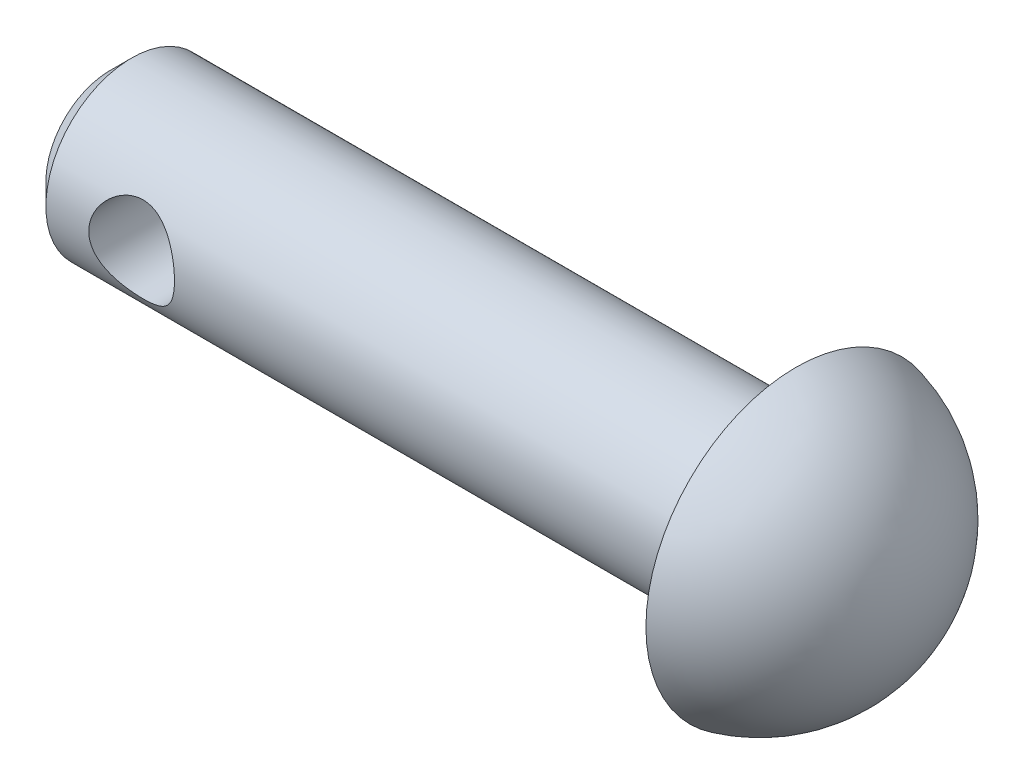
ISO-10303-21;
HEADER;
FILE_DESCRIPTION(('STEP AP214'),'2;1');
FILE_NAME('part.step','',(''),(''),'','','');
FILE_SCHEMA(('AUTOMOTIVE_DESIGN { 1 0 10303 214 1 1 1 1 }'));
ENDSEC;
DATA;
#1=APPLICATION_CONTEXT('core data for automotive mechanical design processes');
#2=APPLICATION_PROTOCOL_DEFINITION('international standard','automotive_design',2000,#1);
#3=PRODUCT_CONTEXT('',#1,'mechanical');
#4=PRODUCT('Part','Part','',(#3));
#5=PRODUCT_RELATED_PRODUCT_CATEGORY('part','',(#4));
#6=PRODUCT_DEFINITION_FORMATION('','',#4);
#7=PRODUCT_DEFINITION_CONTEXT('part definition',#1,'design');
#8=PRODUCT_DEFINITION('design','',#6,#7);
#9=PRODUCT_DEFINITION_SHAPE('','',#8);
#10=(LENGTH_UNIT() NAMED_UNIT(*) SI_UNIT(.MILLI.,.METRE.));
#11=(NAMED_UNIT(*) PLANE_ANGLE_UNIT() SI_UNIT($,.RADIAN.));
#12=(NAMED_UNIT(*) SI_UNIT($,.STERADIAN.) SOLID_ANGLE_UNIT());
#13=UNCERTAINTY_MEASURE_WITH_UNIT(LENGTH_MEASURE(1.E-05),#10,'distance_accuracy_value','');
#14=(GEOMETRIC_REPRESENTATION_CONTEXT(3) GLOBAL_UNCERTAINTY_ASSIGNED_CONTEXT((#13)) GLOBAL_UNIT_ASSIGNED_CONTEXT((#10,
#11,#12)) REPRESENTATION_CONTEXT('',''));
#15=CARTESIAN_POINT('',(0.,0.,0.));
#16=DIRECTION('',(0.,0.,1.));
#17=DIRECTION('',(1.,0.,0.));
#18=AXIS2_PLACEMENT_3D('',#15,#16,#17);
#19=CARTESIAN_POINT('',(-16.,0.,0.));
#20=DIRECTION('',(1.,0.,0.));
#21=DIRECTION('',(0.,0.,-1.));
#22=AXIS2_PLACEMENT_3D('',#19,#20,#21);
#23=CYLINDRICAL_SURFACE('',#22,2.);
#24=CARTESIAN_POINT('',(-15.5,0.,0.));
#25=DIRECTION('',(1.,0.,0.));
#26=DIRECTION('',(0.,0.,-1.));
#27=AXIS2_PLACEMENT_3D('',#24,#25,#26);
#28=CIRCLE('',#27,2.);
#29=CARTESIAN_POINT('',(-15.5,0.,-2.));
#30=VERTEX_POINT('',#29);
#31=EDGE_CURVE('E45',#30,#30,#28,.T.);
#32=ORIENTED_EDGE('',*,*,#31,.T.);
#33=EDGE_LOOP('',(#32));
#34=FACE_BOUND('',#33,.T.);
#35=CARTESIAN_POINT('',(-12.5,0.,-2.));
#36=CARTESIAN_POINT('',(-12.5000033023195,-0.0525719629529866,-1.99999713404151));
#37=CARTESIAN_POINT('',(-12.5041700731217,-0.105206599698033,-1.99790491019518));
#38=CARTESIAN_POINT('',(-12.5206528803409,-0.208920235268425,-1.98974156037396));
#39=CARTESIAN_POINT('',(-12.5329843929976,-0.259996086713504,-1.98366287828984));
#40=CARTESIAN_POINT('',(-12.5651938086168,-0.358933544880575,-1.96816279403312));
#41=CARTESIAN_POINT('',(-12.585042384248,-0.40680680293918,-1.9587543917752));
#42=CARTESIAN_POINT('',(-12.6315706213649,-0.498472616806565,-1.93745776515779));
#43=CARTESIAN_POINT('',(-12.6582497442489,-0.54226549399005,-1.9255697363353));
#44=CARTESIAN_POINT('',(-12.7195172494853,-0.627507817761919,-1.89956258258057));
#45=CARTESIAN_POINT('',(-12.7544864792396,-0.668655211122112,-1.88535199127536));
#46=CARTESIAN_POINT('',(-12.830521479247,-0.744779444866978,-1.85659970246744));
#47=CARTESIAN_POINT('',(-12.8715918517724,-0.779751583106767,-1.84205776209035));
#48=CARTESIAN_POINT('',(-12.9624833495234,-0.845252000450279,-1.81298951197347));
#49=CARTESIAN_POINT('',(-13.0127360983459,-0.875225335551638,-1.79855186970132));
#50=CARTESIAN_POINT('',(-13.1183673359862,-0.926168226890696,-1.77285978772321));
#51=CARTESIAN_POINT('',(-13.1737421287227,-0.947144214966335,-1.7616030760699));
#52=CARTESIAN_POINT('',(-13.2846651054219,-0.97813244218859,-1.74457867037808));
#53=CARTESIAN_POINT('',(-13.3400044520674,-0.988725857080443,-1.73852271583713));
#54=CARTESIAN_POINT('',(-13.4519788377795,-1.00042699330885,-1.73181889948528));
#55=CARTESIAN_POINT('',(-13.5086125408712,-1.00154408837308,-1.73116569343288));
#56=CARTESIAN_POINT('',(-13.6142860243154,-0.994687287172296,-1.73510930257248));
#57=CARTESIAN_POINT('',(-13.6634240312231,-0.987784559536823,-1.73908763662014));
#58=CARTESIAN_POINT('',(-13.759721909373,-0.966939849056934,-1.7507622873385));
#59=CARTESIAN_POINT('',(-13.8068811453053,-0.952995623897653,-1.75845978831776));
#60=CARTESIAN_POINT('',(-13.8992291325657,-0.918209780386005,-1.77687476412741));
#61=CARTESIAN_POINT('',(-13.9443463987858,-0.897215067115996,-1.78765840663998));
#62=CARTESIAN_POINT('',(-14.03063429259,-0.849041687668004,-1.81103404281404));
#63=CARTESIAN_POINT('',(-14.0718031356001,-0.821860243812469,-1.82362684780191));
#64=CARTESIAN_POINT('',(-14.1545212527432,-0.75806605491279,-1.85113157903286));
#65=CARTESIAN_POINT('',(-14.1954568735762,-0.720694458369283,-1.86613510236746));
#66=CARTESIAN_POINT('',(-14.2707354185909,-0.639555578741375,-1.89547623300407));
#67=CARTESIAN_POINT('',(-14.3050751920339,-0.595785256574287,-1.90981351958801));
#68=CARTESIAN_POINT('',(-14.3676856610297,-0.50051650583185,-1.93701987282964));
#69=CARTESIAN_POINT('',(-14.3956004724457,-0.44875359159941,-1.94978984162007));
#70=CARTESIAN_POINT('',(-14.442097029043,-0.340466215488798,-1.97157881121242));
#71=CARTESIAN_POINT('',(-14.4606861850152,-0.283945576265278,-1.98060078943553));
#72=CARTESIAN_POINT('',(-14.4864754037167,-0.172766491660703,-1.99324333741436));
#73=CARTESIAN_POINT('',(-14.4944912357468,-0.118341530548326,-1.99724938301312));
#74=CARTESIAN_POINT('',(-14.5014647311345,-0.00877959994935492,-2.00073013459102));
#75=CARTESIAN_POINT('',(-14.5004266856395,0.0463570198699002,-2.00020698721312));
#76=CARTESIAN_POINT('',(-14.4897933115812,0.151232971985993,-1.99491192253441));
#77=CARTESIAN_POINT('',(-14.48086746727,0.201059408049953,-1.9904724568819));
#78=CARTESIAN_POINT('',(-14.4557619281049,0.298406892301916,-1.97822171314819));
#79=CARTESIAN_POINT('',(-14.4395814335466,0.345927685690996,-1.97041006334333));
#80=CARTESIAN_POINT('',(-14.4000015335668,0.438888608449665,-1.9518425141367));
#81=CARTESIAN_POINT('',(-14.3764089498832,0.484230397006154,-1.94100881769939));
#82=CARTESIAN_POINT('',(-14.322892464354,0.570461361698921,-1.91743974317109));
#83=CARTESIAN_POINT('',(-14.2929658654066,0.611348629775282,-1.90470355565785));
#84=CARTESIAN_POINT('',(-14.2242395746671,0.691767689290653,-1.87708221337464));
#85=CARTESIAN_POINT('',(-14.1848571315464,0.730772077824639,-1.86210884848441));
#86=CARTESIAN_POINT('',(-14.1000748487307,0.80185632111324,-1.83262391603874));
#87=CARTESIAN_POINT('',(-14.0546708811836,0.833931385690841,-1.81811267381526));
#88=CARTESIAN_POINT('',(-13.9563563457997,0.891707914497696,-1.79051192226068));
#89=CARTESIAN_POINT('',(-13.9031887337914,0.917025495878639,-1.77752529663472));
#90=CARTESIAN_POINT('',(-13.7924899323075,0.958082826013804,-1.75574072368126));
#91=CARTESIAN_POINT('',(-13.7349644734988,0.973834915887571,-1.74693738240618));
#92=CARTESIAN_POINT('',(-13.6230897771386,0.99386168744968,-1.73561501008667));
#93=CARTESIAN_POINT('',(-13.568965746571,0.999092996400866,-1.73257383460491));
#94=CARTESIAN_POINT('',(-13.4605529328293,1.00068915438079,-1.73165354646175));
#95=CARTESIAN_POINT('',(-13.4062642312606,0.9970578466244,-1.73377219627553));
#96=CARTESIAN_POINT('',(-13.304516498468,0.981926125592265,-1.74237862050025));
#97=CARTESIAN_POINT('',(-13.2568995298556,0.971208314342801,-1.74843094482394));
#98=CARTESIAN_POINT('',(-13.1641918805753,0.943175358224647,-1.76371016187917));
#99=CARTESIAN_POINT('',(-13.119102017908,0.925858091159812,-1.77293807569675));
#100=CARTESIAN_POINT('',(-13.0293751490134,0.883815745300685,-1.79428530364528));
#101=CARTESIAN_POINT('',(-12.9849720981703,0.85867113781646,-1.80655722396191));
#102=CARTESIAN_POINT('',(-12.9007254638194,0.802150971636637,-1.8323533163459));
#103=CARTESIAN_POINT('',(-12.8608842694815,0.77077217123865,-1.84587813794522));
#104=CARTESIAN_POINT('',(-12.7818580176424,0.698203326664643,-1.87462323159313));
#105=CARTESIAN_POINT('',(-12.7433408976381,0.656284423010173,-1.88984983311469));
#106=CARTESIAN_POINT('',(-12.6737370165764,0.56615480622028,-1.91877752255088));
#107=CARTESIAN_POINT('',(-12.6426542605737,0.517940723256786,-1.9324777860804));
#108=CARTESIAN_POINT('',(-12.5887636372378,0.415931596819948,-1.95698009585103));
#109=CARTESIAN_POINT('',(-12.5660158305886,0.362099503934616,-1.96776096562909));
#110=CARTESIAN_POINT('',(-12.530191832081,0.250742101294193,-1.98501341363465));
#111=CARTESIAN_POINT('',(-12.5170881531704,0.193227799623168,-1.99149723372932));
#112=CARTESIAN_POINT('',(-12.5061025889241,0.112601946483385,-1.99695461909663));
#113=CARTESIAN_POINT('',(-12.5038173591364,0.0901618794395,-1.99809365339202));
#114=CARTESIAN_POINT('',(-12.5007653344832,0.0451517318071585,-1.99961696977865));
#115=CARTESIAN_POINT('',(-12.4999985815288,0.0225816476473818,-2.00000123103763));
#116=CARTESIAN_POINT('',(-12.5,0.,-2.));
#117=B_SPLINE_CURVE_WITH_KNOTS('',3,(#35,#36,#37,#38,#39,#40,#41,#42,#43,#44,#45,#46,#47,#48,
#49,#50,#51,#52,#53,#54,#55,#56,#57,#58,#59,#60,#61,#62,#63,#64,#65,#66,#67,#68,#69,#70,#71,#72,
#73,#74,#75,#76,#77,#78,#79,#80,#81,#82,#83,#84,#85,#86,#87,#88,#89,#90,#91,#92,#93,#94,#95,#96,
#97,#98,#99,#100,#101,#102,#103,#104,#105,#106,#107,#108,#109,#110,#111,#112,#113,#114,#115,
#116),.UNSPECIFIED.,.T.,.F.,(4,2,2,2,2,2,2,2,2,2,2,2,2,2,2,2,2,2,2,2,2,2,2,2,2,2,2,2,2,2,2,2,2,
2,2,2,2,2,2,2,4),(0.,0.157624257420293,0.315548149709198,0.472862155492298,0.630163760581568,
0.796981758718089,0.963926237654036,1.14381726430753,1.32357947898281,1.4925801214023,
1.66141357329021,1.81005712409321,1.95874803925679,2.11090240168487,2.26312521260222,
2.43464941333879,2.60625534598687,2.78583022214441,2.9652621691228,3.12983290471346,
3.29432564511476,3.44606906506122,3.59782921630932,3.75392856027899,3.9100945074834,
4.08159610644419,4.25321588615432,4.43314682159675,4.61284511940778,4.77529307498374,
4.93767059860006,5.08457930244183,5.23153528783678,5.38836456775615,5.54527561138958,
5.72125242752499,5.89732383376573,6.07464013662926,6.25144908624931,6.31915280137698,
6.38685838514848),.UNSPECIFIED.);
#118=CARTESIAN_POINT('',(-12.5,0.,-2.));
#119=VERTEX_POINT('',#118);
#120=EDGE_CURVE('E50',#119,#119,#117,.T.);
#121=ORIENTED_EDGE('',*,*,#120,.F.);
#122=EDGE_LOOP('',(#121));
#123=FACE_BOUND('',#122,.T.);
#124=CARTESIAN_POINT('',(-12.5,0.,2.));
#125=CARTESIAN_POINT('',(-12.5000033023195,0.0525719629529866,1.99999713404151));
#126=CARTESIAN_POINT('',(-12.5041700731217,0.105206599698033,1.99790491019518));
#127=CARTESIAN_POINT('',(-12.5206528803409,0.208920235268425,1.98974156037396));
#128=CARTESIAN_POINT('',(-12.5329843929976,0.259996086713504,1.98366287828984));
#129=CARTESIAN_POINT('',(-12.5651938086168,0.358933544880575,1.96816279403312));
#130=CARTESIAN_POINT('',(-12.585042384248,0.40680680293918,1.9587543917752));
#131=CARTESIAN_POINT('',(-12.6315706213649,0.498472616806565,1.93745776515779));
#132=CARTESIAN_POINT('',(-12.6582497442489,0.54226549399005,1.9255697363353));
#133=CARTESIAN_POINT('',(-12.7195172494853,0.627507817761919,1.89956258258057));
#134=CARTESIAN_POINT('',(-12.7544864792396,0.668655211122112,1.88535199127536));
#135=CARTESIAN_POINT('',(-12.830521479247,0.744779444866978,1.85659970246744));
#136=CARTESIAN_POINT('',(-12.8715918517724,0.779751583106767,1.84205776209035));
#137=CARTESIAN_POINT('',(-12.9624833495234,0.845252000450279,1.81298951197347));
#138=CARTESIAN_POINT('',(-13.0127360983459,0.875225335551638,1.79855186970132));
#139=CARTESIAN_POINT('',(-13.1183673359862,0.926168226890696,1.77285978772321));
#140=CARTESIAN_POINT('',(-13.1737421287227,0.947144214966335,1.7616030760699));
#141=CARTESIAN_POINT('',(-13.2846651054219,0.97813244218859,1.74457867037808));
#142=CARTESIAN_POINT('',(-13.3400044520674,0.988725857080443,1.73852271583713));
#143=CARTESIAN_POINT('',(-13.4519788377795,1.00042699330885,1.73181889948528));
#144=CARTESIAN_POINT('',(-13.5086125408712,1.00154408837308,1.73116569343288));
#145=CARTESIAN_POINT('',(-13.6142860243154,0.994687287172296,1.73510930257248));
#146=CARTESIAN_POINT('',(-13.6634240312231,0.987784559536823,1.73908763662014));
#147=CARTESIAN_POINT('',(-13.759721909373,0.966939849056934,1.7507622873385));
#148=CARTESIAN_POINT('',(-13.8068811453053,0.952995623897653,1.75845978831776));
#149=CARTESIAN_POINT('',(-13.8992291325657,0.918209780386005,1.77687476412741));
#150=CARTESIAN_POINT('',(-13.9443463987858,0.897215067115996,1.78765840663998));
#151=CARTESIAN_POINT('',(-14.03063429259,0.849041687668004,1.81103404281404));
#152=CARTESIAN_POINT('',(-14.0718031356001,0.821860243812469,1.82362684780191));
#153=CARTESIAN_POINT('',(-14.1545212527432,0.75806605491279,1.85113157903286));
#154=CARTESIAN_POINT('',(-14.1954568735762,0.720694458369283,1.86613510236746));
#155=CARTESIAN_POINT('',(-14.2707354185909,0.639555578741375,1.89547623300407));
#156=CARTESIAN_POINT('',(-14.3050751920339,0.595785256574287,1.90981351958801));
#157=CARTESIAN_POINT('',(-14.3676856610297,0.50051650583185,1.93701987282964));
#158=CARTESIAN_POINT('',(-14.3956004724457,0.44875359159941,1.94978984162007));
#159=CARTESIAN_POINT('',(-14.442097029043,0.340466215488798,1.97157881121242));
#160=CARTESIAN_POINT('',(-14.4606861850152,0.283945576265278,1.98060078943553));
#161=CARTESIAN_POINT('',(-14.4864754037167,0.172766491660703,1.99324333741436));
#162=CARTESIAN_POINT('',(-14.4944912357468,0.118341530548326,1.99724938301312));
#163=CARTESIAN_POINT('',(-14.5014647311345,0.00877959994935492,2.00073013459102));
#164=CARTESIAN_POINT('',(-14.5004266856395,-0.0463570198699002,2.00020698721312));
#165=CARTESIAN_POINT('',(-14.4897933115812,-0.151232971985993,1.99491192253441));
#166=CARTESIAN_POINT('',(-14.48086746727,-0.201059408049953,1.9904724568819));
#167=CARTESIAN_POINT('',(-14.4557619281049,-0.298406892301916,1.97822171314819));
#168=CARTESIAN_POINT('',(-14.4395814335466,-0.345927685690996,1.97041006334333));
#169=CARTESIAN_POINT('',(-14.4000015335668,-0.438888608449665,1.9518425141367));
#170=CARTESIAN_POINT('',(-14.3764089498832,-0.484230397006154,1.94100881769939));
#171=CARTESIAN_POINT('',(-14.322892464354,-0.570461361698921,1.91743974317109));
#172=CARTESIAN_POINT('',(-14.2929658654066,-0.611348629775282,1.90470355565785));
#173=CARTESIAN_POINT('',(-14.2242395746671,-0.691767689290653,1.87708221337464));
#174=CARTESIAN_POINT('',(-14.1848571315464,-0.730772077824639,1.86210884848441));
#175=CARTESIAN_POINT('',(-14.1000748487307,-0.80185632111324,1.83262391603874));
#176=CARTESIAN_POINT('',(-14.0546708811836,-0.833931385690841,1.81811267381526));
#177=CARTESIAN_POINT('',(-13.9563563457997,-0.891707914497696,1.79051192226068));
#178=CARTESIAN_POINT('',(-13.9031887337914,-0.917025495878639,1.77752529663472));
#179=CARTESIAN_POINT('',(-13.7924899323075,-0.958082826013804,1.75574072368126));
#180=CARTESIAN_POINT('',(-13.7349644734988,-0.973834915887571,1.74693738240618));
#181=CARTESIAN_POINT('',(-13.6230897771386,-0.99386168744968,1.73561501008667));
#182=CARTESIAN_POINT('',(-13.568965746571,-0.999092996400866,1.73257383460491));
#183=CARTESIAN_POINT('',(-13.4605529328293,-1.00068915438079,1.73165354646175));
#184=CARTESIAN_POINT('',(-13.4062642312606,-0.9970578466244,1.73377219627553));
#185=CARTESIAN_POINT('',(-13.304516498468,-0.981926125592265,1.74237862050025));
#186=CARTESIAN_POINT('',(-13.2568995298556,-0.971208314342801,1.74843094482394));
#187=CARTESIAN_POINT('',(-13.1641918805753,-0.943175358224647,1.76371016187917));
#188=CARTESIAN_POINT('',(-13.119102017908,-0.925858091159812,1.77293807569675));
#189=CARTESIAN_POINT('',(-13.0293751490134,-0.883815745300685,1.79428530364528));
#190=CARTESIAN_POINT('',(-12.9849720981703,-0.85867113781646,1.80655722396191));
#191=CARTESIAN_POINT('',(-12.9007254638194,-0.802150971636637,1.8323533163459));
#192=CARTESIAN_POINT('',(-12.8608842694815,-0.77077217123865,1.84587813794522));
#193=CARTESIAN_POINT('',(-12.7818580176424,-0.698203326664643,1.87462323159313));
#194=CARTESIAN_POINT('',(-12.7433408976381,-0.656284423010173,1.88984983311469));
#195=CARTESIAN_POINT('',(-12.6737370165764,-0.56615480622028,1.91877752255088));
#196=CARTESIAN_POINT('',(-12.6426542605737,-0.517940723256786,1.9324777860804));
#197=CARTESIAN_POINT('',(-12.5887636372378,-0.415931596819948,1.95698009585103));
#198=CARTESIAN_POINT('',(-12.5660158305886,-0.362099503934616,1.96776096562909));
#199=CARTESIAN_POINT('',(-12.530191832081,-0.250742101294193,1.98501341363465));
#200=CARTESIAN_POINT('',(-12.5170881531704,-0.193227799623168,1.99149723372932));
#201=CARTESIAN_POINT('',(-12.5061025889241,-0.112601946483385,1.99695461909663));
#202=CARTESIAN_POINT('',(-12.5038173591364,-0.0901618794395,1.99809365339202));
#203=CARTESIAN_POINT('',(-12.5007653344832,-0.0451517318071585,1.99961696977865));
#204=CARTESIAN_POINT('',(-12.4999985815288,-0.0225816476473818,2.00000123103763));
#205=CARTESIAN_POINT('',(-12.5,0.,2.));
#206=B_SPLINE_CURVE_WITH_KNOTS('',3,(#124,#125,#126,#127,#128,#129,#130,#131,#132,#133,#134,
#135,#136,#137,#138,#139,#140,#141,#142,#143,#144,#145,#146,#147,#148,#149,#150,#151,#152,#153,
#154,#155,#156,#157,#158,#159,#160,#161,#162,#163,#164,#165,#166,#167,#168,#169,#170,#171,#172,
#173,#174,#175,#176,#177,#178,#179,#180,#181,#182,#183,#184,#185,#186,#187,#188,#189,#190,#191,
#192,#193,#194,#195,#196,#197,#198,#199,#200,#201,#202,#203,#204,#205),.UNSPECIFIED.,.T.,.F.,(4,
2,2,2,2,2,2,2,2,2,2,2,2,2,2,2,2,2,2,2,2,2,2,2,2,2,2,2,2,2,2,2,2,2,2,2,2,2,2,2,4),(0.,
0.157624257420293,0.315548149709198,0.472862155492298,0.630163760581568,0.796981758718089,
0.963926237654036,1.14381726430753,1.32357947898281,1.4925801214023,1.66141357329021,
1.81005712409321,1.95874803925679,2.11090240168487,2.26312521260222,2.43464941333879,
2.60625534598687,2.78583022214441,2.9652621691228,3.12983290471346,3.29432564511476,
3.44606906506122,3.59782921630932,3.75392856027899,3.9100945074834,4.08159610644419,
4.25321588615432,4.43314682159675,4.61284511940778,4.77529307498374,4.93767059860006,
5.08457930244183,5.23153528783678,5.38836456775615,5.54527561138958,5.72125242752499,
5.89732383376573,6.07464013662926,6.25144908624931,6.31915280137698,6.38685838514848),.UNSPECIFIED.);
#207=CARTESIAN_POINT('',(-12.5,0.,2.));
#208=VERTEX_POINT('',#207);
#209=EDGE_CURVE('E55',#208,#208,#206,.T.);
#210=ORIENTED_EDGE('',*,*,#209,.F.);
#211=EDGE_LOOP('',(#210));
#212=FACE_BOUND('',#211,.T.);
#213=CARTESIAN_POINT('',(0.,0.,0.));
#214=DIRECTION('',(1.,0.,0.));
#215=DIRECTION('',(0.,0.,-1.));
#216=AXIS2_PLACEMENT_3D('',#213,#214,#215);
#217=CIRCLE('',#216,2.);
#218=CARTESIAN_POINT('',(0.,0.,-2.));
#219=VERTEX_POINT('',#218);
#220=EDGE_CURVE('E91',#219,#219,#217,.T.);
#221=ORIENTED_EDGE('',*,*,#220,.F.);
#222=EDGE_LOOP('',(#221));
#223=FACE_BOUND('',#222,.T.);
#224=ADVANCED_FACE('F37',(#34,#123,#212,#223),#23,.T.);
#225=CARTESIAN_POINT('',(-16.,0.,0.));
#226=DIRECTION('',(1.,0.,0.));
#227=DIRECTION('',(0.,0.,-1.));
#228=AXIS2_PLACEMENT_3D('',#225,#226,#227);
#229=PLANE('',#228);
#230=CARTESIAN_POINT('',(-16.,0.,0.));
#231=DIRECTION('',(1.,0.,0.));
#232=DIRECTION('',(0.,0.,-1.));
#233=AXIS2_PLACEMENT_3D('',#230,#231,#232);
#234=CIRCLE('',#233,1.5);
#235=CARTESIAN_POINT('',(-16.,0.,-1.5));
#236=VERTEX_POINT('',#235);
#237=EDGE_CURVE('E10',#236,#236,#234,.F.);
#238=ORIENTED_EDGE('',*,*,#237,.T.);
#239=EDGE_LOOP('',(#238));
#240=FACE_BOUND('',#239,.T.);
#241=ADVANCED_FACE('F73',(#240),#229,.F.);
#242=CARTESIAN_POINT('',(-13.5,0.,-2.));
#243=DIRECTION('',(0.,0.,1.));
#244=DIRECTION('',(1.,0.,0.));
#245=AXIS2_PLACEMENT_3D('',#242,#243,#244);
#246=CYLINDRICAL_SURFACE('',#245,1.);
#247=ORIENTED_EDGE('',*,*,#120,.T.);
#248=EDGE_LOOP('',(#247));
#249=FACE_BOUND('',#248,.T.);
#250=ORIENTED_EDGE('',*,*,#209,.T.);
#251=EDGE_LOOP('',(#250));
#252=FACE_BOUND('',#251,.T.);
#253=ADVANCED_FACE('F68',(#249,#252),#246,.F.);
#254=CARTESIAN_POINT('',(-0.842614977317635,0.,0.));
#255=DIRECTION('',(-1.,0.,0.));
#256=DIRECTION('',(0.,0.,-1.));
#257=AXIS2_PLACEMENT_3D('',#254,#255,#256);
#258=SPHERICAL_SURFACE('',#257,3.6);
#259=CARTESIAN_POINT('',(0.,0.,0.));
#260=DIRECTION('',(-1.,0.,0.));
#261=DIRECTION('',(0.,0.,1.));
#262=AXIS2_PLACEMENT_3D('',#259,#260,#261);
#263=CIRCLE('',#262,3.5);
#264=CARTESIAN_POINT('',(0.,0.,3.5));
#265=VERTEX_POINT('',#264);
#266=EDGE_CURVE('E94',#265,#265,#263,.T.);
#267=ORIENTED_EDGE('',*,*,#266,.F.);
#268=EDGE_LOOP('',(#267));
#269=FACE_BOUND('',#268,.T.);
#270=ADVANCED_FACE('F72',(#269),#258,.T.);
#271=CARTESIAN_POINT('',(0.,0.,0.));
#272=DIRECTION('',(1.,0.,0.));
#273=DIRECTION('',(0.,0.,-1.));
#274=AXIS2_PLACEMENT_3D('',#271,#272,#273);
#275=PLANE('',#274);
#276=ORIENTED_EDGE('',*,*,#220,.T.);
#277=EDGE_LOOP('',(#276));
#278=FACE_BOUND('',#277,.T.);
#279=ORIENTED_EDGE('',*,*,#266,.T.);
#280=EDGE_LOOP('',(#279));
#281=FACE_BOUND('',#280,.T.);
#282=ADVANCED_FACE('F101',(#278,#281),#275,.F.);
#283=CARTESIAN_POINT('',(-15.5,0.,0.));
#284=DIRECTION('',(1.,0.,0.));
#285=DIRECTION('',(0.,0.,-1.));
#286=AXIS2_PLACEMENT_3D('',#283,#284,#285);
#287=CONICAL_SURFACE('',#286,2.,0.785398163397452);
#288=ORIENTED_EDGE('',*,*,#237,.F.);
#289=EDGE_LOOP('',(#288));
#290=FACE_BOUND('',#289,.T.);
#291=ORIENTED_EDGE('',*,*,#31,.F.);
#292=EDGE_LOOP('',(#291));
#293=FACE_BOUND('',#292,.T.);
#294=ADVANCED_FACE('F39',(#290,#293),#287,.T.);
#295=CLOSED_SHELL('',(#224,#241,#253,#270,#282,#294));
#296=MANIFOLD_SOLID_BREP('B2',#295);
#297=ADVANCED_BREP_SHAPE_REPRESENTATION('',(#18,#296),#14);
#298=SHAPE_DEFINITION_REPRESENTATION(#9,#297);
ENDSEC;
END-ISO-10303-21;
